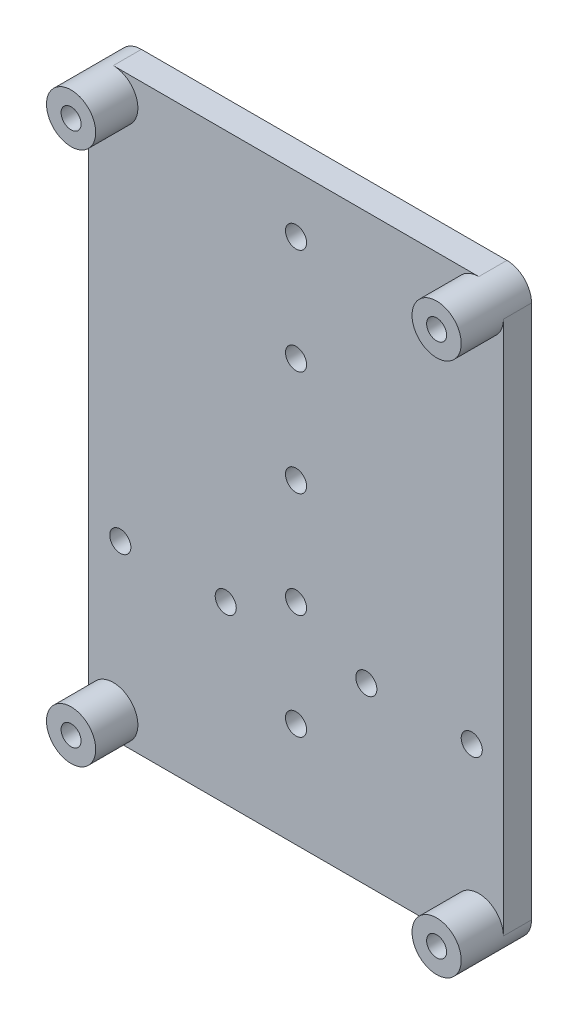
ISO-10303-21;
HEADER;
FILE_DESCRIPTION(('STEP AP214'),'2;1');
FILE_NAME('part.step','',(''),(''),'','','');
FILE_SCHEMA(('AUTOMOTIVE_DESIGN { 1 0 10303 214 1 1 1 1 }'));
ENDSEC;
DATA;
#1=APPLICATION_CONTEXT('core data for automotive mechanical design processes');
#2=APPLICATION_PROTOCOL_DEFINITION('international standard','automotive_design',2000,#1);
#3=PRODUCT_CONTEXT('',#1,'mechanical');
#4=PRODUCT('Part','Part','',(#3));
#5=PRODUCT_RELATED_PRODUCT_CATEGORY('part','',(#4));
#6=PRODUCT_DEFINITION_FORMATION('','',#4);
#7=PRODUCT_DEFINITION_CONTEXT('part definition',#1,'design');
#8=PRODUCT_DEFINITION('design','',#6,#7);
#9=PRODUCT_DEFINITION_SHAPE('','',#8);
#10=(LENGTH_UNIT() NAMED_UNIT(*) SI_UNIT(.MILLI.,.METRE.));
#11=(NAMED_UNIT(*) PLANE_ANGLE_UNIT() SI_UNIT($,.RADIAN.));
#12=(NAMED_UNIT(*) SI_UNIT($,.STERADIAN.) SOLID_ANGLE_UNIT());
#13=UNCERTAINTY_MEASURE_WITH_UNIT(LENGTH_MEASURE(1.E-05),#10,'distance_accuracy_value','');
#14=(GEOMETRIC_REPRESENTATION_CONTEXT(3) GLOBAL_UNCERTAINTY_ASSIGNED_CONTEXT((#13)) GLOBAL_UNIT_ASSIGNED_CONTEXT((#10,
#11,#12)) REPRESENTATION_CONTEXT('',''));
#15=CARTESIAN_POINT('',(0.,0.,0.));
#16=DIRECTION('',(0.,0.,1.));
#17=DIRECTION('',(1.,0.,0.));
#18=AXIS2_PLACEMENT_3D('',#15,#16,#17);
#19=CARTESIAN_POINT('',(108.526557276723,189.230165260636,193.266714262562));
#20=DIRECTION('',(0.,0.,1.));
#21=DIRECTION('',(1.,0.,0.));
#22=AXIS2_PLACEMENT_3D('',#19,#20,#21);
#23=PLANE('',#22);
#24=CARTESIAN_POINT('',(134.526557276723,184.637085274738,193.266714262562));
#25=DIRECTION('',(0.,0.,1.));
#26=DIRECTION('',(1.,0.,0.));
#27=AXIS2_PLACEMENT_3D('',#24,#25,#26);
#28=CIRCLE('',#27,1.5);
#29=CARTESIAN_POINT('',(136.026557276723,184.637085274738,193.266714262562));
#30=VERTEX_POINT('',#29);
#31=EDGE_CURVE('E172',#30,#30,#28,.T.);
#32=ORIENTED_EDGE('',*,*,#31,.F.);
#33=EDGE_LOOP('',(#32));
#34=FACE_BOUND('',#33,.T.);
#35=CARTESIAN_POINT('',(134.526557276723,154.637085274738,193.266714262562));
#36=DIRECTION('',(0.,0.,1.));
#37=DIRECTION('',(1.,0.,0.));
#38=AXIS2_PLACEMENT_3D('',#35,#36,#37);
#39=CIRCLE('',#38,1.5);
#40=CARTESIAN_POINT('',(136.026557276723,154.637085274738,193.266714262562));
#41=VERTEX_POINT('',#40);
#42=EDGE_CURVE('E184',#41,#41,#39,.T.);
#43=ORIENTED_EDGE('',*,*,#42,.F.);
#44=EDGE_LOOP('',(#43));
#45=FACE_BOUND('',#44,.T.);
#46=CARTESIAN_POINT('',(144.526557276723,134.637085274738,193.266714262562));
#47=DIRECTION('',(0.,0.,1.));
#48=DIRECTION('',(1.,0.,0.));
#49=AXIS2_PLACEMENT_3D('',#46,#47,#48);
#50=CIRCLE('',#49,1.5);
#51=CARTESIAN_POINT('',(146.026557276723,134.637085274738,193.266714262562));
#52=VERTEX_POINT('',#51);
#53=EDGE_CURVE('E196',#52,#52,#50,.T.);
#54=ORIENTED_EDGE('',*,*,#53,.F.);
#55=EDGE_LOOP('',(#54));
#56=FACE_BOUND('',#55,.T.);
#57=CARTESIAN_POINT('',(124.526557276723,134.637085274738,193.266714262562));
#58=DIRECTION('',(0.,0.,1.));
#59=DIRECTION('',(1.,0.,0.));
#60=AXIS2_PLACEMENT_3D('',#57,#58,#59);
#61=CIRCLE('',#60,1.49999999999998);
#62=CARTESIAN_POINT('',(126.026557276723,134.637085274738,193.266714262562));
#63=VERTEX_POINT('',#62);
#64=EDGE_CURVE('E208',#63,#63,#61,.T.);
#65=ORIENTED_EDGE('',*,*,#64,.F.);
#66=EDGE_LOOP('',(#65));
#67=FACE_BOUND('',#66,.T.);
#68=CARTESIAN_POINT('',(134.526557276723,124.637085274738,193.266714262562));
#69=DIRECTION('',(0.,0.,1.));
#70=DIRECTION('',(1.,0.,0.));
#71=AXIS2_PLACEMENT_3D('',#68,#69,#70);
#72=CIRCLE('',#71,1.5);
#73=CARTESIAN_POINT('',(136.026557276723,124.637085274738,193.266714262562));
#74=VERTEX_POINT('',#73);
#75=EDGE_CURVE('E220',#74,#74,#72,.T.);
#76=ORIENTED_EDGE('',*,*,#75,.F.);
#77=EDGE_LOOP('',(#76));
#78=FACE_BOUND('',#77,.T.);
#79=CARTESIAN_POINT('',(109.526557276723,134.637085274738,193.266714262562));
#80=DIRECTION('',(0.,0.,1.));
#81=DIRECTION('',(1.,0.,0.));
#82=AXIS2_PLACEMENT_3D('',#79,#80,#81);
#83=CIRCLE('',#82,1.5);
#84=CARTESIAN_POINT('',(111.026557276723,134.637085274738,193.266714262562));
#85=VERTEX_POINT('',#84);
#86=EDGE_CURVE('E214',#85,#85,#83,.T.);
#87=ORIENTED_EDGE('',*,*,#86,.F.);
#88=EDGE_LOOP('',(#87));
#89=FACE_BOUND('',#88,.T.);
#90=CARTESIAN_POINT('',(159.526557276723,134.637085274738,193.266714262562));
#91=DIRECTION('',(0.,0.,1.));
#92=DIRECTION('',(1.,0.,0.));
#93=AXIS2_PLACEMENT_3D('',#90,#91,#92);
#94=CIRCLE('',#93,1.49999999999997);
#95=CARTESIAN_POINT('',(161.026557276723,134.637085274738,193.266714262562));
#96=VERTEX_POINT('',#95);
#97=EDGE_CURVE('E202',#96,#96,#94,.T.);
#98=ORIENTED_EDGE('',*,*,#97,.F.);
#99=EDGE_LOOP('',(#98));
#100=FACE_BOUND('',#99,.T.);
#101=CARTESIAN_POINT('',(134.526557276723,139.637085274738,193.266714262562));
#102=DIRECTION('',(0.,0.,1.));
#103=DIRECTION('',(1.,0.,0.));
#104=AXIS2_PLACEMENT_3D('',#101,#102,#103);
#105=CIRCLE('',#104,1.5);
#106=CARTESIAN_POINT('',(136.026557276723,139.637085274738,193.266714262562));
#107=VERTEX_POINT('',#106);
#108=EDGE_CURVE('E190',#107,#107,#105,.T.);
#109=ORIENTED_EDGE('',*,*,#108,.F.);
#110=EDGE_LOOP('',(#109));
#111=FACE_BOUND('',#110,.T.);
#112=CARTESIAN_POINT('',(134.526557276723,169.637085274738,193.266714262562));
#113=DIRECTION('',(0.,0.,1.));
#114=DIRECTION('',(1.,0.,0.));
#115=AXIS2_PLACEMENT_3D('',#112,#113,#114);
#116=CIRCLE('',#115,1.5);
#117=CARTESIAN_POINT('',(136.026557276723,169.637085274738,193.266714262562));
#118=VERTEX_POINT('',#117);
#119=EDGE_CURVE('E178',#118,#118,#116,.T.);
#120=ORIENTED_EDGE('',*,*,#119,.F.);
#121=EDGE_LOOP('',(#120));
#122=FACE_BOUND('',#121,.T.);
#123=DIRECTION('',(1.,0.,0.));
#124=VECTOR('',#123,1.);
#125=CARTESIAN_POINT('',(108.526557276723,109.730165260636,193.266714262562));
#126=LINE('',#125,#124);
#127=CARTESIAN_POINT('',(108.526557276723,109.730165260636,193.266714262562));
#128=VERTEX_POINT('',#127);
#129=CARTESIAN_POINT('',(160.526557276723,109.730165260636,193.266714262562));
#130=VERTEX_POINT('',#129);
#131=EDGE_CURVE('E114',#128,#130,#126,.T.);
#132=ORIENTED_EDGE('',*,*,#131,.T.);
#133=CARTESIAN_POINT('',(160.526557276723,113.230165260636,193.266714262562));
#134=DIRECTION('',(0.,0.,1.));
#135=DIRECTION('',(1.,0.,0.));
#136=AXIS2_PLACEMENT_3D('',#133,#134,#135);
#137=CIRCLE('',#136,3.50000000000002);
#138=CARTESIAN_POINT('',(164.026557276723,113.230165260636,193.266714262562));
#139=VERTEX_POINT('',#138);
#140=EDGE_CURVE('E121',#139,#130,#137,.T.);
#141=ORIENTED_EDGE('',*,*,#140,.F.);
#142=DIRECTION('',(0.,1.,0.));
#143=VECTOR('',#142,1.);
#144=CARTESIAN_POINT('',(164.026557276723,113.230165260636,193.266714262562));
#145=LINE('',#144,#143);
#146=CARTESIAN_POINT('',(164.026557276723,189.230165260636,193.266714262562));
#147=VERTEX_POINT('',#146);
#148=EDGE_CURVE('E51',#139,#147,#145,.T.);
#149=ORIENTED_EDGE('',*,*,#148,.T.);
#150=CARTESIAN_POINT('',(160.526557276723,189.230165260636,193.266714262562));
#151=DIRECTION('',(0.,0.,1.));
#152=DIRECTION('',(1.,0.,0.));
#153=AXIS2_PLACEMENT_3D('',#150,#151,#152);
#154=CIRCLE('',#153,3.49999999999999);
#155=CARTESIAN_POINT('',(160.526557276723,192.730165260636,193.266714262562));
#156=VERTEX_POINT('',#155);
#157=EDGE_CURVE('E148',#156,#147,#154,.T.);
#158=ORIENTED_EDGE('',*,*,#157,.F.);
#159=DIRECTION('',(-1.,0.,0.));
#160=VECTOR('',#159,1.);
#161=CARTESIAN_POINT('',(160.526557276723,192.730165260636,193.266714262562));
#162=LINE('',#161,#160);
#163=CARTESIAN_POINT('',(108.526557276723,192.730165260636,193.266714262562));
#164=VERTEX_POINT('',#163);
#165=EDGE_CURVE('E113',#156,#164,#162,.T.);
#166=ORIENTED_EDGE('',*,*,#165,.T.);
#167=CARTESIAN_POINT('',(108.526557276723,189.230165260636,193.266714262562));
#168=DIRECTION('',(0.,0.,1.));
#169=DIRECTION('',(1.,0.,0.));
#170=AXIS2_PLACEMENT_3D('',#167,#168,#169);
#171=CIRCLE('',#170,3.50000000000002);
#172=CARTESIAN_POINT('',(105.026557276723,189.230165260636,193.266714262562));
#173=VERTEX_POINT('',#172);
#174=EDGE_CURVE('E11',#173,#164,#171,.T.);
#175=ORIENTED_EDGE('',*,*,#174,.F.);
#176=DIRECTION('',(0.,-1.,0.));
#177=VECTOR('',#176,1.);
#178=CARTESIAN_POINT('',(105.026557276723,189.230165260636,193.266714262562));
#179=LINE('',#178,#177);
#180=CARTESIAN_POINT('',(105.026557276723,113.230165260636,193.266714262562));
#181=VERTEX_POINT('',#180);
#182=EDGE_CURVE('E226',#173,#181,#179,.T.);
#183=ORIENTED_EDGE('',*,*,#182,.T.);
#184=CARTESIAN_POINT('',(108.526557276723,113.230165260636,193.266714262562));
#185=DIRECTION('',(0.,0.,1.));
#186=DIRECTION('',(1.,0.,0.));
#187=AXIS2_PLACEMENT_3D('',#184,#185,#186);
#188=CIRCLE('',#187,3.50000000000002);
#189=EDGE_CURVE('E139',#128,#181,#188,.T.);
#190=ORIENTED_EDGE('',*,*,#189,.F.);
#191=EDGE_LOOP('',(#132,#141,#149,#158,#166,#175,#183,#190));
#192=FACE_BOUND('',#191,.T.);
#193=ADVANCED_FACE('F33',(#34,#45,#56,#67,#78,#89,#100,#111,#122,#192),#23,.T.);
#194=CARTESIAN_POINT('',(108.526557276723,189.230165260636,189.266714262562));
#195=DIRECTION('',(0.,0.,1.));
#196=DIRECTION('',(1.,0.,0.));
#197=AXIS2_PLACEMENT_3D('',#194,#195,#196);
#198=PLANE('',#197);
#199=CARTESIAN_POINT('',(108.526557276723,189.230165260636,189.266714262562));
#200=DIRECTION('',(0.,0.,1.));
#201=DIRECTION('',(1.,0.,0.));
#202=AXIS2_PLACEMENT_3D('',#199,#200,#201);
#203=CIRCLE('',#202,3.5);
#204=CARTESIAN_POINT('',(108.526557276723,192.730165260636,189.266714262562));
#205=VERTEX_POINT('',#204);
#206=CARTESIAN_POINT('',(105.026557276723,189.230165260636,189.266714262562));
#207=VERTEX_POINT('',#206);
#208=EDGE_CURVE('E223',#205,#207,#203,.T.);
#209=ORIENTED_EDGE('',*,*,#208,.F.);
#210=DIRECTION('',(-1.,0.,0.));
#211=VECTOR('',#210,1.);
#212=CARTESIAN_POINT('',(160.526557276723,192.730165260636,189.266714262562));
#213=LINE('',#212,#211);
#214=CARTESIAN_POINT('',(160.526557276723,192.730165260636,189.266714262562));
#215=VERTEX_POINT('',#214);
#216=EDGE_CURVE('E89',#215,#205,#213,.T.);
#217=ORIENTED_EDGE('',*,*,#216,.F.);
#218=CARTESIAN_POINT('',(160.526557276723,189.230165260636,189.266714262562));
#219=DIRECTION('',(0.,0.,1.));
#220=DIRECTION('',(1.,0.,0.));
#221=AXIS2_PLACEMENT_3D('',#218,#219,#220);
#222=CIRCLE('',#221,3.5);
#223=CARTESIAN_POINT('',(164.026557276723,189.230165260636,189.266714262562));
#224=VERTEX_POINT('',#223);
#225=EDGE_CURVE('E82',#224,#215,#222,.T.);
#226=ORIENTED_EDGE('',*,*,#225,.F.);
#227=DIRECTION('',(0.,1.,0.));
#228=VECTOR('',#227,1.);
#229=CARTESIAN_POINT('',(164.026557276723,113.230165260636,189.266714262562));
#230=LINE('',#229,#228);
#231=CARTESIAN_POINT('',(164.026557276723,113.230165260636,189.266714262562));
#232=VERTEX_POINT('',#231);
#233=EDGE_CURVE('E240',#232,#224,#230,.T.);
#234=ORIENTED_EDGE('',*,*,#233,.F.);
#235=CARTESIAN_POINT('',(160.526557276723,113.230165260636,189.266714262562));
#236=DIRECTION('',(0.,0.,1.));
#237=DIRECTION('',(1.,0.,0.));
#238=AXIS2_PLACEMENT_3D('',#235,#236,#237);
#239=CIRCLE('',#238,3.50000000000002);
#240=CARTESIAN_POINT('',(160.526557276723,109.730165260636,189.266714262562));
#241=VERTEX_POINT('',#240);
#242=EDGE_CURVE('E123',#241,#232,#239,.T.);
#243=ORIENTED_EDGE('',*,*,#242,.F.);
#244=DIRECTION('',(1.,0.,0.));
#245=VECTOR('',#244,1.);
#246=CARTESIAN_POINT('',(108.526557276723,109.730165260636,189.266714262562));
#247=LINE('',#246,#245);
#248=CARTESIAN_POINT('',(108.526557276723,109.730165260636,189.266714262562));
#249=VERTEX_POINT('',#248);
#250=EDGE_CURVE('E237',#249,#241,#247,.T.);
#251=ORIENTED_EDGE('',*,*,#250,.F.);
#252=CARTESIAN_POINT('',(108.526557276723,113.230165260636,189.266714262562));
#253=DIRECTION('',(0.,0.,1.));
#254=DIRECTION('',(1.,0.,0.));
#255=AXIS2_PLACEMENT_3D('',#252,#253,#254);
#256=CIRCLE('',#255,3.50000000000002);
#257=CARTESIAN_POINT('',(105.026557276723,113.230165260636,189.266714262562));
#258=VERTEX_POINT('',#257);
#259=EDGE_CURVE('E235',#258,#249,#256,.T.);
#260=ORIENTED_EDGE('',*,*,#259,.F.);
#261=DIRECTION('',(0.,-1.,0.));
#262=VECTOR('',#261,1.);
#263=CARTESIAN_POINT('',(105.026557276723,189.230165260636,189.266714262562));
#264=LINE('',#263,#262);
#265=EDGE_CURVE('E233',#207,#258,#264,.T.);
#266=ORIENTED_EDGE('',*,*,#265,.F.);
#267=EDGE_LOOP('',(#209,#217,#226,#234,#243,#251,#260,#266));
#268=FACE_BOUND('',#267,.T.);
#269=CARTESIAN_POINT('',(134.526557276723,124.637085274738,189.266714262562));
#270=DIRECTION('',(0.,0.,1.));
#271=DIRECTION('',(1.,0.,0.));
#272=AXIS2_PLACEMENT_3D('',#269,#270,#271);
#273=CIRCLE('',#272,1.5);
#274=CARTESIAN_POINT('',(136.026557276723,124.637085274738,189.266714262562));
#275=VERTEX_POINT('',#274);
#276=EDGE_CURVE('E217',#275,#275,#273,.T.);
#277=ORIENTED_EDGE('',*,*,#276,.T.);
#278=EDGE_LOOP('',(#277));
#279=FACE_BOUND('',#278,.T.);
#280=CARTESIAN_POINT('',(109.526557276723,134.637085274738,189.266714262562));
#281=DIRECTION('',(0.,0.,1.));
#282=DIRECTION('',(1.,0.,0.));
#283=AXIS2_PLACEMENT_3D('',#280,#281,#282);
#284=CIRCLE('',#283,1.5);
#285=CARTESIAN_POINT('',(111.026557276723,134.637085274738,189.266714262562));
#286=VERTEX_POINT('',#285);
#287=EDGE_CURVE('E211',#286,#286,#284,.T.);
#288=ORIENTED_EDGE('',*,*,#287,.T.);
#289=EDGE_LOOP('',(#288));
#290=FACE_BOUND('',#289,.T.);
#291=CARTESIAN_POINT('',(124.526557276723,134.637085274738,189.266714262562));
#292=DIRECTION('',(0.,0.,1.));
#293=DIRECTION('',(1.,0.,0.));
#294=AXIS2_PLACEMENT_3D('',#291,#292,#293);
#295=CIRCLE('',#294,1.49999999999998);
#296=CARTESIAN_POINT('',(126.026557276723,134.637085274738,189.266714262562));
#297=VERTEX_POINT('',#296);
#298=EDGE_CURVE('E205',#297,#297,#295,.T.);
#299=ORIENTED_EDGE('',*,*,#298,.T.);
#300=EDGE_LOOP('',(#299));
#301=FACE_BOUND('',#300,.T.);
#302=CARTESIAN_POINT('',(159.526557276723,134.637085274738,189.266714262562));
#303=DIRECTION('',(0.,0.,1.));
#304=DIRECTION('',(1.,0.,0.));
#305=AXIS2_PLACEMENT_3D('',#302,#303,#304);
#306=CIRCLE('',#305,1.49999999999997);
#307=CARTESIAN_POINT('',(161.026557276723,134.637085274738,189.266714262562));
#308=VERTEX_POINT('',#307);
#309=EDGE_CURVE('E199',#308,#308,#306,.T.);
#310=ORIENTED_EDGE('',*,*,#309,.T.);
#311=EDGE_LOOP('',(#310));
#312=FACE_BOUND('',#311,.T.);
#313=CARTESIAN_POINT('',(144.526557276723,134.637085274738,189.266714262562));
#314=DIRECTION('',(0.,0.,1.));
#315=DIRECTION('',(1.,0.,0.));
#316=AXIS2_PLACEMENT_3D('',#313,#314,#315);
#317=CIRCLE('',#316,1.5);
#318=CARTESIAN_POINT('',(146.026557276723,134.637085274738,189.266714262562));
#319=VERTEX_POINT('',#318);
#320=EDGE_CURVE('E193',#319,#319,#317,.T.);
#321=ORIENTED_EDGE('',*,*,#320,.T.);
#322=EDGE_LOOP('',(#321));
#323=FACE_BOUND('',#322,.T.);
#324=CARTESIAN_POINT('',(134.526557276723,139.637085274738,189.266714262562));
#325=DIRECTION('',(0.,0.,1.));
#326=DIRECTION('',(1.,0.,0.));
#327=AXIS2_PLACEMENT_3D('',#324,#325,#326);
#328=CIRCLE('',#327,1.5);
#329=CARTESIAN_POINT('',(136.026557276723,139.637085274738,189.266714262562));
#330=VERTEX_POINT('',#329);
#331=EDGE_CURVE('E187',#330,#330,#328,.T.);
#332=ORIENTED_EDGE('',*,*,#331,.T.);
#333=EDGE_LOOP('',(#332));
#334=FACE_BOUND('',#333,.T.);
#335=CARTESIAN_POINT('',(134.526557276723,154.637085274738,189.266714262562));
#336=DIRECTION('',(0.,0.,1.));
#337=DIRECTION('',(1.,0.,0.));
#338=AXIS2_PLACEMENT_3D('',#335,#336,#337);
#339=CIRCLE('',#338,1.5);
#340=CARTESIAN_POINT('',(136.026557276723,154.637085274738,189.266714262562));
#341=VERTEX_POINT('',#340);
#342=EDGE_CURVE('E181',#341,#341,#339,.T.);
#343=ORIENTED_EDGE('',*,*,#342,.T.);
#344=EDGE_LOOP('',(#343));
#345=FACE_BOUND('',#344,.T.);
#346=CARTESIAN_POINT('',(134.526557276723,169.637085274738,189.266714262562));
#347=DIRECTION('',(0.,0.,1.));
#348=DIRECTION('',(1.,0.,0.));
#349=AXIS2_PLACEMENT_3D('',#346,#347,#348);
#350=CIRCLE('',#349,1.5);
#351=CARTESIAN_POINT('',(136.026557276723,169.637085274738,189.266714262562));
#352=VERTEX_POINT('',#351);
#353=EDGE_CURVE('E175',#352,#352,#350,.T.);
#354=ORIENTED_EDGE('',*,*,#353,.T.);
#355=EDGE_LOOP('',(#354));
#356=FACE_BOUND('',#355,.T.);
#357=CARTESIAN_POINT('',(134.526557276723,184.637085274738,189.266714262562));
#358=DIRECTION('',(0.,0.,1.));
#359=DIRECTION('',(1.,0.,0.));
#360=AXIS2_PLACEMENT_3D('',#357,#358,#359);
#361=CIRCLE('',#360,1.5);
#362=CARTESIAN_POINT('',(136.026557276723,184.637085274738,189.266714262562));
#363=VERTEX_POINT('',#362);
#364=EDGE_CURVE('E171',#363,#363,#361,.T.);
#365=ORIENTED_EDGE('',*,*,#364,.T.);
#366=EDGE_LOOP('',(#365));
#367=FACE_BOUND('',#366,.T.);
#368=CARTESIAN_POINT('',(108.526557276723,189.230165260636,189.266714262562));
#369=DIRECTION('',(0.,0.,1.));
#370=DIRECTION('',(1.,0.,0.));
#371=AXIS2_PLACEMENT_3D('',#368,#369,#370);
#372=CIRCLE('',#371,1.42240000000001);
#373=CARTESIAN_POINT('',(109.948957276723,189.230165260636,189.266714262562));
#374=VERTEX_POINT('',#373);
#375=EDGE_CURVE('E168',#374,#374,#372,.T.);
#376=ORIENTED_EDGE('',*,*,#375,.T.);
#377=EDGE_LOOP('',(#376));
#378=FACE_BOUND('',#377,.T.);
#379=CARTESIAN_POINT('',(160.526557276723,189.230165260636,189.266714262562));
#380=DIRECTION('',(0.,0.,1.));
#381=DIRECTION('',(1.,0.,0.));
#382=AXIS2_PLACEMENT_3D('',#379,#380,#381);
#383=CIRCLE('',#382,1.42240000000002);
#384=CARTESIAN_POINT('',(161.948957276723,189.230165260636,189.266714262562));
#385=VERTEX_POINT('',#384);
#386=EDGE_CURVE('E165',#385,#385,#383,.T.);
#387=ORIENTED_EDGE('',*,*,#386,.T.);
#388=EDGE_LOOP('',(#387));
#389=FACE_BOUND('',#388,.T.);
#390=CARTESIAN_POINT('',(160.526557276723,113.230165260636,189.266714262562));
#391=DIRECTION('',(0.,0.,1.));
#392=DIRECTION('',(1.,0.,0.));
#393=AXIS2_PLACEMENT_3D('',#390,#391,#392);
#394=CIRCLE('',#393,1.42240000000002);
#395=CARTESIAN_POINT('',(161.948957276723,113.230165260636,189.266714262562));
#396=VERTEX_POINT('',#395);
#397=EDGE_CURVE('E162',#396,#396,#394,.T.);
#398=ORIENTED_EDGE('',*,*,#397,.T.);
#399=EDGE_LOOP('',(#398));
#400=FACE_BOUND('',#399,.T.);
#401=CARTESIAN_POINT('',(108.526557276723,113.230165260636,189.266714262562));
#402=DIRECTION('',(0.,0.,1.));
#403=DIRECTION('',(1.,0.,0.));
#404=AXIS2_PLACEMENT_3D('',#401,#402,#403);
#405=CIRCLE('',#404,1.4224);
#406=CARTESIAN_POINT('',(109.948957276723,113.230165260636,189.266714262562));
#407=VERTEX_POINT('',#406);
#408=EDGE_CURVE('E158',#407,#407,#405,.T.);
#409=ORIENTED_EDGE('',*,*,#408,.T.);
#410=EDGE_LOOP('',(#409));
#411=FACE_BOUND('',#410,.T.);
#412=ADVANCED_FACE('F264',(#268,#279,#290,#301,#312,#323,#334,#345,#356,#367,#378,#389,#400,
#411),#198,.F.);
#413=CARTESIAN_POINT('',(108.526557276723,189.230165260636,193.266714262562));
#414=DIRECTION('',(0.,0.,-1.));
#415=DIRECTION('',(-1.,0.,0.));
#416=AXIS2_PLACEMENT_3D('',#413,#414,#415);
#417=CYLINDRICAL_SURFACE('',#416,3.5);
#418=ORIENTED_EDGE('',*,*,#208,.T.);
#419=DIRECTION('',(0.,0.,-1.));
#420=VECTOR('',#419,1.);
#421=CARTESIAN_POINT('',(105.026557276723,189.230165260636,193.266714262562));
#422=LINE('',#421,#420);
#423=EDGE_CURVE('E37',#173,#207,#422,.T.);
#424=ORIENTED_EDGE('',*,*,#423,.F.);
#425=ORIENTED_EDGE('',*,*,#174,.T.);
#426=DIRECTION('',(0.,0.,-1.));
#427=VECTOR('',#426,1.);
#428=CARTESIAN_POINT('',(108.526557276723,192.730165260636,193.266714262562));
#429=LINE('',#428,#427);
#430=EDGE_CURVE('E230',#164,#205,#429,.T.);
#431=ORIENTED_EDGE('',*,*,#430,.T.);
#432=EDGE_LOOP('',(#418,#424,#425,#431));
#433=FACE_BOUND('',#432,.T.);
#434=CARTESIAN_POINT('',(108.526557276723,189.230165260636,199.266714262562));
#435=DIRECTION('',(0.,0.,1.));
#436=DIRECTION('',(1.,0.,0.));
#437=AXIS2_PLACEMENT_3D('',#434,#435,#436);
#438=CIRCLE('',#437,3.50000000000002);
#439=CARTESIAN_POINT('',(112.026557276723,189.230165260636,199.266714262562));
#440=VERTEX_POINT('',#439);
#441=EDGE_CURVE('E156',#440,#440,#438,.T.);
#442=ORIENTED_EDGE('',*,*,#441,.F.);
#443=EDGE_LOOP('',(#442));
#444=FACE_BOUND('',#443,.T.);
#445=ADVANCED_FACE('F35',(#433,#444),#417,.T.);
#446=CARTESIAN_POINT('',(105.026557276723,189.230165260636,193.266714262562));
#447=DIRECTION('',(1.,0.,0.));
#448=DIRECTION('',(0.,1.,0.));
#449=AXIS2_PLACEMENT_3D('',#446,#447,#448);
#450=PLANE('',#449);
#451=ORIENTED_EDGE('',*,*,#265,.T.);
#452=DIRECTION('',(0.,0.,-1.));
#453=VECTOR('',#452,1.);
#454=CARTESIAN_POINT('',(105.026557276723,113.230165260636,193.266714262562));
#455=LINE('',#454,#453);
#456=EDGE_CURVE('E251',#181,#258,#455,.T.);
#457=ORIENTED_EDGE('',*,*,#456,.F.);
#458=ORIENTED_EDGE('',*,*,#182,.F.);
#459=ORIENTED_EDGE('',*,*,#423,.T.);
#460=EDGE_LOOP('',(#451,#457,#458,#459));
#461=FACE_BOUND('',#460,.T.);
#462=ADVANCED_FACE('F259',(#461),#450,.F.);
#463=CARTESIAN_POINT('',(108.526557276723,113.230165260636,193.266714262562));
#464=DIRECTION('',(0.,0.,-1.));
#465=DIRECTION('',(-1.,0.,0.));
#466=AXIS2_PLACEMENT_3D('',#463,#464,#465);
#467=CYLINDRICAL_SURFACE('',#466,3.50000000000002);
#468=ORIENTED_EDGE('',*,*,#259,.T.);
#469=DIRECTION('',(0.,0.,-1.));
#470=VECTOR('',#469,1.);
#471=CARTESIAN_POINT('',(108.526557276723,109.730165260636,193.266714262562));
#472=LINE('',#471,#470);
#473=EDGE_CURVE('E249',#128,#249,#472,.T.);
#474=ORIENTED_EDGE('',*,*,#473,.F.);
#475=ORIENTED_EDGE('',*,*,#189,.T.);
#476=ORIENTED_EDGE('',*,*,#456,.T.);
#477=EDGE_LOOP('',(#468,#474,#475,#476));
#478=FACE_BOUND('',#477,.T.);
#479=CARTESIAN_POINT('',(108.526557276723,113.230165260636,199.266714262562));
#480=DIRECTION('',(0.,0.,1.));
#481=DIRECTION('',(1.,0.,0.));
#482=AXIS2_PLACEMENT_3D('',#479,#480,#481);
#483=CIRCLE('',#482,3.50000000000002);
#484=CARTESIAN_POINT('',(112.026557276723,113.230165260636,199.266714262562));
#485=VERTEX_POINT('',#484);
#486=EDGE_CURVE('E140',#485,#485,#483,.T.);
#487=ORIENTED_EDGE('',*,*,#486,.F.);
#488=EDGE_LOOP('',(#487));
#489=FACE_BOUND('',#488,.T.);
#490=ADVANCED_FACE('F268',(#478,#489),#467,.T.);
#491=CARTESIAN_POINT('',(108.526557276723,109.730165260636,193.266714262562));
#492=DIRECTION('',(0.,1.,0.));
#493=DIRECTION('',(-1.,0.,0.));
#494=AXIS2_PLACEMENT_3D('',#491,#492,#493);
#495=PLANE('',#494);
#496=ORIENTED_EDGE('',*,*,#250,.T.);
#497=DIRECTION('',(0.,0.,-1.));
#498=VECTOR('',#497,1.);
#499=CARTESIAN_POINT('',(160.526557276723,109.730165260636,193.266714262562));
#500=LINE('',#499,#498);
#501=EDGE_CURVE('E124',#130,#241,#500,.T.);
#502=ORIENTED_EDGE('',*,*,#501,.F.);
#503=ORIENTED_EDGE('',*,*,#131,.F.);
#504=ORIENTED_EDGE('',*,*,#473,.T.);
#505=EDGE_LOOP('',(#496,#502,#503,#504));
#506=FACE_BOUND('',#505,.T.);
#507=ADVANCED_FACE('F271',(#506),#495,.F.);
#508=CARTESIAN_POINT('',(160.526557276723,113.230165260636,193.266714262562));
#509=DIRECTION('',(0.,0.,-1.));
#510=DIRECTION('',(-1.,0.,0.));
#511=AXIS2_PLACEMENT_3D('',#508,#509,#510);
#512=CYLINDRICAL_SURFACE('',#511,3.50000000000002);
#513=ORIENTED_EDGE('',*,*,#242,.T.);
#514=DIRECTION('',(0.,0.,-1.));
#515=VECTOR('',#514,1.);
#516=CARTESIAN_POINT('',(164.026557276723,113.230165260636,193.266714262562));
#517=LINE('',#516,#515);
#518=EDGE_CURVE('E109',#139,#232,#517,.T.);
#519=ORIENTED_EDGE('',*,*,#518,.F.);
#520=ORIENTED_EDGE('',*,*,#140,.T.);
#521=ORIENTED_EDGE('',*,*,#501,.T.);
#522=EDGE_LOOP('',(#513,#519,#520,#521));
#523=FACE_BOUND('',#522,.T.);
#524=CARTESIAN_POINT('',(160.526557276723,113.230165260636,199.266714262562));
#525=DIRECTION('',(0.,0.,1.));
#526=DIRECTION('',(1.,0.,0.));
#527=AXIS2_PLACEMENT_3D('',#524,#525,#526);
#528=CIRCLE('',#527,3.50000000000002);
#529=CARTESIAN_POINT('',(164.026557276723,113.230165260636,199.266714262562));
#530=VERTEX_POINT('',#529);
#531=EDGE_CURVE('E128',#530,#530,#528,.T.);
#532=ORIENTED_EDGE('',*,*,#531,.F.);
#533=EDGE_LOOP('',(#532));
#534=FACE_BOUND('',#533,.T.);
#535=ADVANCED_FACE('F118',(#523,#534),#512,.T.);
#536=CARTESIAN_POINT('',(164.026557276723,113.230165260636,193.266714262562));
#537=DIRECTION('',(-1.,0.,0.));
#538=DIRECTION('',(0.,-1.,0.));
#539=AXIS2_PLACEMENT_3D('',#536,#537,#538);
#540=PLANE('',#539);
#541=ORIENTED_EDGE('',*,*,#233,.T.);
#542=DIRECTION('',(0.,0.,-1.));
#543=VECTOR('',#542,1.);
#544=CARTESIAN_POINT('',(164.026557276723,189.230165260636,193.266714262562));
#545=LINE('',#544,#543);
#546=EDGE_CURVE('E111',#147,#224,#545,.T.);
#547=ORIENTED_EDGE('',*,*,#546,.F.);
#548=ORIENTED_EDGE('',*,*,#148,.F.);
#549=ORIENTED_EDGE('',*,*,#518,.T.);
#550=EDGE_LOOP('',(#541,#547,#548,#549));
#551=FACE_BOUND('',#550,.T.);
#552=ADVANCED_FACE('F108',(#551),#540,.F.);
#553=CARTESIAN_POINT('',(160.526557276723,189.230165260636,193.266714262562));
#554=DIRECTION('',(0.,0.,-1.));
#555=DIRECTION('',(-1.,0.,0.));
#556=AXIS2_PLACEMENT_3D('',#553,#554,#555);
#557=CYLINDRICAL_SURFACE('',#556,3.5);
#558=ORIENTED_EDGE('',*,*,#225,.T.);
#559=DIRECTION('',(0.,0.,-1.));
#560=VECTOR('',#559,1.);
#561=CARTESIAN_POINT('',(160.526557276723,192.730165260636,193.266714262562));
#562=LINE('',#561,#560);
#563=EDGE_CURVE('E245',#156,#215,#562,.T.);
#564=ORIENTED_EDGE('',*,*,#563,.F.);
#565=ORIENTED_EDGE('',*,*,#157,.T.);
#566=ORIENTED_EDGE('',*,*,#546,.T.);
#567=EDGE_LOOP('',(#558,#564,#565,#566));
#568=FACE_BOUND('',#567,.T.);
#569=CARTESIAN_POINT('',(160.526557276723,189.230165260636,199.266714262562));
#570=DIRECTION('',(0.,0.,1.));
#571=DIRECTION('',(1.,0.,0.));
#572=AXIS2_PLACEMENT_3D('',#569,#570,#571);
#573=CIRCLE('',#572,3.49999999999999);
#574=CARTESIAN_POINT('',(164.026557276723,189.230165260636,199.266714262562));
#575=VERTEX_POINT('',#574);
#576=EDGE_CURVE('E149',#575,#575,#573,.T.);
#577=ORIENTED_EDGE('',*,*,#576,.F.);
#578=EDGE_LOOP('',(#577));
#579=FACE_BOUND('',#578,.T.);
#580=ADVANCED_FACE('F272',(#568,#579),#557,.T.);
#581=CARTESIAN_POINT('',(160.526557276723,192.730165260636,193.266714262562));
#582=DIRECTION('',(0.,-1.,0.));
#583=DIRECTION('',(0.,0.,-1.));
#584=AXIS2_PLACEMENT_3D('',#581,#582,#583);
#585=PLANE('',#584);
#586=ORIENTED_EDGE('',*,*,#216,.T.);
#587=ORIENTED_EDGE('',*,*,#430,.F.);
#588=ORIENTED_EDGE('',*,*,#165,.F.);
#589=ORIENTED_EDGE('',*,*,#563,.T.);
#590=EDGE_LOOP('',(#586,#587,#588,#589));
#591=FACE_BOUND('',#590,.T.);
#592=ADVANCED_FACE('F274',(#591),#585,.F.);
#593=CARTESIAN_POINT('',(134.526557276723,124.637085274738,193.266714262562));
#594=DIRECTION('',(0.,0.,-1.));
#595=DIRECTION('',(-1.,0.,0.));
#596=AXIS2_PLACEMENT_3D('',#593,#594,#595);
#597=CYLINDRICAL_SURFACE('',#596,1.5);
#598=ORIENTED_EDGE('',*,*,#75,.T.);
#599=EDGE_LOOP('',(#598));
#600=FACE_BOUND('',#599,.T.);
#601=ORIENTED_EDGE('',*,*,#276,.F.);
#602=EDGE_LOOP('',(#601));
#603=FACE_BOUND('',#602,.T.);
#604=ADVANCED_FACE('F276',(#600,#603),#597,.F.);
#605=CARTESIAN_POINT('',(109.526557276723,134.637085274738,193.266714262562));
#606=DIRECTION('',(0.,0.,-1.));
#607=DIRECTION('',(-1.,0.,0.));
#608=AXIS2_PLACEMENT_3D('',#605,#606,#607);
#609=CYLINDRICAL_SURFACE('',#608,1.5);
#610=ORIENTED_EDGE('',*,*,#86,.T.);
#611=EDGE_LOOP('',(#610));
#612=FACE_BOUND('',#611,.T.);
#613=ORIENTED_EDGE('',*,*,#287,.F.);
#614=EDGE_LOOP('',(#613));
#615=FACE_BOUND('',#614,.T.);
#616=ADVANCED_FACE('F282',(#612,#615),#609,.F.);
#617=CARTESIAN_POINT('',(124.526557276723,134.637085274738,193.266714262562));
#618=DIRECTION('',(0.,0.,-1.));
#619=DIRECTION('',(-1.,0.,0.));
#620=AXIS2_PLACEMENT_3D('',#617,#618,#619);
#621=CYLINDRICAL_SURFACE('',#620,1.49999999999998);
#622=ORIENTED_EDGE('',*,*,#64,.T.);
#623=EDGE_LOOP('',(#622));
#624=FACE_BOUND('',#623,.T.);
#625=ORIENTED_EDGE('',*,*,#298,.F.);
#626=EDGE_LOOP('',(#625));
#627=FACE_BOUND('',#626,.T.);
#628=ADVANCED_FACE('F298',(#624,#627),#621,.F.);
#629=CARTESIAN_POINT('',(159.526557276723,134.637085274738,193.266714262562));
#630=DIRECTION('',(0.,0.,-1.));
#631=DIRECTION('',(-1.,0.,0.));
#632=AXIS2_PLACEMENT_3D('',#629,#630,#631);
#633=CYLINDRICAL_SURFACE('',#632,1.49999999999997);
#634=ORIENTED_EDGE('',*,*,#97,.T.);
#635=EDGE_LOOP('',(#634));
#636=FACE_BOUND('',#635,.T.);
#637=ORIENTED_EDGE('',*,*,#309,.F.);
#638=EDGE_LOOP('',(#637));
#639=FACE_BOUND('',#638,.T.);
#640=ADVANCED_FACE('F302',(#636,#639),#633,.F.);
#641=CARTESIAN_POINT('',(144.526557276723,134.637085274738,193.266714262562));
#642=DIRECTION('',(0.,0.,-1.));
#643=DIRECTION('',(-1.,0.,0.));
#644=AXIS2_PLACEMENT_3D('',#641,#642,#643);
#645=CYLINDRICAL_SURFACE('',#644,1.5);
#646=ORIENTED_EDGE('',*,*,#53,.T.);
#647=EDGE_LOOP('',(#646));
#648=FACE_BOUND('',#647,.T.);
#649=ORIENTED_EDGE('',*,*,#320,.F.);
#650=EDGE_LOOP('',(#649));
#651=FACE_BOUND('',#650,.T.);
#652=ADVANCED_FACE('F306',(#648,#651),#645,.F.);
#653=CARTESIAN_POINT('',(134.526557276723,139.637085274738,193.266714262562));
#654=DIRECTION('',(0.,0.,-1.));
#655=DIRECTION('',(-1.,0.,0.));
#656=AXIS2_PLACEMENT_3D('',#653,#654,#655);
#657=CYLINDRICAL_SURFACE('',#656,1.5);
#658=ORIENTED_EDGE('',*,*,#108,.T.);
#659=EDGE_LOOP('',(#658));
#660=FACE_BOUND('',#659,.T.);
#661=ORIENTED_EDGE('',*,*,#331,.F.);
#662=EDGE_LOOP('',(#661));
#663=FACE_BOUND('',#662,.T.);
#664=ADVANCED_FACE('F310',(#660,#663),#657,.F.);
#665=CARTESIAN_POINT('',(134.526557276723,154.637085274738,193.266714262562));
#666=DIRECTION('',(0.,0.,-1.));
#667=DIRECTION('',(-1.,0.,0.));
#668=AXIS2_PLACEMENT_3D('',#665,#666,#667);
#669=CYLINDRICAL_SURFACE('',#668,1.5);
#670=ORIENTED_EDGE('',*,*,#42,.T.);
#671=EDGE_LOOP('',(#670));
#672=FACE_BOUND('',#671,.T.);
#673=ORIENTED_EDGE('',*,*,#342,.F.);
#674=EDGE_LOOP('',(#673));
#675=FACE_BOUND('',#674,.T.);
#676=ADVANCED_FACE('F314',(#672,#675),#669,.F.);
#677=CARTESIAN_POINT('',(134.526557276723,169.637085274738,193.266714262562));
#678=DIRECTION('',(0.,0.,-1.));
#679=DIRECTION('',(-1.,0.,0.));
#680=AXIS2_PLACEMENT_3D('',#677,#678,#679);
#681=CYLINDRICAL_SURFACE('',#680,1.5);
#682=ORIENTED_EDGE('',*,*,#119,.T.);
#683=EDGE_LOOP('',(#682));
#684=FACE_BOUND('',#683,.T.);
#685=ORIENTED_EDGE('',*,*,#353,.F.);
#686=EDGE_LOOP('',(#685));
#687=FACE_BOUND('',#686,.T.);
#688=ADVANCED_FACE('F318',(#684,#687),#681,.F.);
#689=CARTESIAN_POINT('',(134.526557276723,184.637085274738,193.266714262562));
#690=DIRECTION('',(0.,0.,-1.));
#691=DIRECTION('',(-1.,0.,0.));
#692=AXIS2_PLACEMENT_3D('',#689,#690,#691);
#693=CYLINDRICAL_SURFACE('',#692,1.5);
#694=ORIENTED_EDGE('',*,*,#31,.T.);
#695=EDGE_LOOP('',(#694));
#696=FACE_BOUND('',#695,.T.);
#697=ORIENTED_EDGE('',*,*,#364,.F.);
#698=EDGE_LOOP('',(#697));
#699=FACE_BOUND('',#698,.T.);
#700=ADVANCED_FACE('F322',(#696,#699),#693,.F.);
#701=CARTESIAN_POINT('',(108.526557276723,189.230165260636,193.266714262562));
#702=DIRECTION('',(0.,0.,-1.));
#703=DIRECTION('',(-1.,0.,0.));
#704=AXIS2_PLACEMENT_3D('',#701,#702,#703);
#705=CYLINDRICAL_SURFACE('',#704,1.42240000000001);
#706=ORIENTED_EDGE('',*,*,#375,.F.);
#707=EDGE_LOOP('',(#706));
#708=FACE_BOUND('',#707,.T.);
#709=CARTESIAN_POINT('',(108.526557276723,189.230165260636,199.266714262562));
#710=DIRECTION('',(0.,0.,1.));
#711=DIRECTION('',(1.,0.,0.));
#712=AXIS2_PLACEMENT_3D('',#709,#710,#711);
#713=CIRCLE('',#712,1.42240000000001);
#714=CARTESIAN_POINT('',(109.948957276723,189.230165260636,199.266714262562));
#715=VERTEX_POINT('',#714);
#716=EDGE_CURVE('E152',#715,#715,#713,.T.);
#717=ORIENTED_EDGE('',*,*,#716,.T.);
#718=EDGE_LOOP('',(#717));
#719=FACE_BOUND('',#718,.T.);
#720=ADVANCED_FACE('F326',(#708,#719),#705,.F.);
#721=CARTESIAN_POINT('',(160.526557276723,189.230165260636,193.266714262562));
#722=DIRECTION('',(0.,0.,-1.));
#723=DIRECTION('',(-1.,0.,0.));
#724=AXIS2_PLACEMENT_3D('',#721,#722,#723);
#725=CYLINDRICAL_SURFACE('',#724,1.42240000000002);
#726=ORIENTED_EDGE('',*,*,#386,.F.);
#727=EDGE_LOOP('',(#726));
#728=FACE_BOUND('',#727,.T.);
#729=CARTESIAN_POINT('',(160.526557276723,189.230165260636,199.266714262562));
#730=DIRECTION('',(0.,0.,1.));
#731=DIRECTION('',(1.,0.,0.));
#732=AXIS2_PLACEMENT_3D('',#729,#730,#731);
#733=CIRCLE('',#732,1.42240000000002);
#734=CARTESIAN_POINT('',(161.948957276723,189.230165260636,199.266714262562));
#735=VERTEX_POINT('',#734);
#736=EDGE_CURVE('E143',#735,#735,#733,.T.);
#737=ORIENTED_EDGE('',*,*,#736,.T.);
#738=EDGE_LOOP('',(#737));
#739=FACE_BOUND('',#738,.T.);
#740=ADVANCED_FACE('F330',(#728,#739),#725,.F.);
#741=CARTESIAN_POINT('',(160.526557276723,113.230165260636,193.266714262562));
#742=DIRECTION('',(0.,0.,-1.));
#743=DIRECTION('',(-1.,0.,0.));
#744=AXIS2_PLACEMENT_3D('',#741,#742,#743);
#745=CYLINDRICAL_SURFACE('',#744,1.42240000000002);
#746=ORIENTED_EDGE('',*,*,#397,.F.);
#747=EDGE_LOOP('',(#746));
#748=FACE_BOUND('',#747,.T.);
#749=CARTESIAN_POINT('',(160.526557276723,113.230165260636,199.266714262562));
#750=DIRECTION('',(0.,0.,1.));
#751=DIRECTION('',(1.,0.,0.));
#752=AXIS2_PLACEMENT_3D('',#749,#750,#751);
#753=CIRCLE('',#752,1.42240000000002);
#754=CARTESIAN_POINT('',(161.948957276723,113.230165260636,199.266714262562));
#755=VERTEX_POINT('',#754);
#756=EDGE_CURVE('E129',#755,#755,#753,.T.);
#757=ORIENTED_EDGE('',*,*,#756,.T.);
#758=EDGE_LOOP('',(#757));
#759=FACE_BOUND('',#758,.T.);
#760=ADVANCED_FACE('F334',(#748,#759),#745,.F.);
#761=CARTESIAN_POINT('',(108.526557276723,113.230165260636,193.266714262562));
#762=DIRECTION('',(0.,0.,-1.));
#763=DIRECTION('',(-1.,0.,0.));
#764=AXIS2_PLACEMENT_3D('',#761,#762,#763);
#765=CYLINDRICAL_SURFACE('',#764,1.4224);
#766=ORIENTED_EDGE('',*,*,#408,.F.);
#767=EDGE_LOOP('',(#766));
#768=FACE_BOUND('',#767,.T.);
#769=CARTESIAN_POINT('',(108.526557276723,113.230165260636,199.266714262562));
#770=DIRECTION('',(0.,0.,1.));
#771=DIRECTION('',(1.,0.,0.));
#772=AXIS2_PLACEMENT_3D('',#769,#770,#771);
#773=CIRCLE('',#772,1.4224);
#774=CARTESIAN_POINT('',(109.948957276723,113.230165260636,199.266714262562));
#775=VERTEX_POINT('',#774);
#776=EDGE_CURVE('E132',#775,#775,#773,.T.);
#777=ORIENTED_EDGE('',*,*,#776,.T.);
#778=EDGE_LOOP('',(#777));
#779=FACE_BOUND('',#778,.T.);
#780=ADVANCED_FACE('F338',(#768,#779),#765,.F.);
#781=CARTESIAN_POINT('',(108.526557276723,189.230165260636,199.266714262562));
#782=DIRECTION('',(0.,0.,1.));
#783=DIRECTION('',(1.,0.,0.));
#784=AXIS2_PLACEMENT_3D('',#781,#782,#783);
#785=PLANE('',#784);
#786=ORIENTED_EDGE('',*,*,#441,.T.);
#787=EDGE_LOOP('',(#786));
#788=FACE_BOUND('',#787,.T.);
#789=ORIENTED_EDGE('',*,*,#716,.F.);
#790=EDGE_LOOP('',(#789));
#791=FACE_BOUND('',#790,.T.);
#792=ADVANCED_FACE('F342',(#788,#791),#785,.T.);
#793=CARTESIAN_POINT('',(160.526557276723,189.230165260636,199.266714262562));
#794=DIRECTION('',(0.,0.,1.));
#795=DIRECTION('',(1.,0.,0.));
#796=AXIS2_PLACEMENT_3D('',#793,#794,#795);
#797=PLANE('',#796);
#798=ORIENTED_EDGE('',*,*,#576,.T.);
#799=EDGE_LOOP('',(#798));
#800=FACE_BOUND('',#799,.T.);
#801=ORIENTED_EDGE('',*,*,#736,.F.);
#802=EDGE_LOOP('',(#801));
#803=FACE_BOUND('',#802,.T.);
#804=ADVANCED_FACE('F346',(#800,#803),#797,.T.);
#805=CARTESIAN_POINT('',(108.526557276723,113.230165260636,199.266714262562));
#806=DIRECTION('',(0.,0.,1.));
#807=DIRECTION('',(1.,0.,0.));
#808=AXIS2_PLACEMENT_3D('',#805,#806,#807);
#809=PLANE('',#808);
#810=ORIENTED_EDGE('',*,*,#486,.T.);
#811=EDGE_LOOP('',(#810));
#812=FACE_BOUND('',#811,.T.);
#813=ORIENTED_EDGE('',*,*,#776,.F.);
#814=EDGE_LOOP('',(#813));
#815=FACE_BOUND('',#814,.T.);
#816=ADVANCED_FACE('F350',(#812,#815),#809,.T.);
#817=CARTESIAN_POINT('',(160.526557276723,113.230165260636,199.266714262562));
#818=DIRECTION('',(0.,0.,1.));
#819=DIRECTION('',(1.,0.,0.));
#820=AXIS2_PLACEMENT_3D('',#817,#818,#819);
#821=PLANE('',#820);
#822=ORIENTED_EDGE('',*,*,#531,.T.);
#823=EDGE_LOOP('',(#822));
#824=FACE_BOUND('',#823,.T.);
#825=ORIENTED_EDGE('',*,*,#756,.F.);
#826=EDGE_LOOP('',(#825));
#827=FACE_BOUND('',#826,.T.);
#828=ADVANCED_FACE('F354',(#824,#827),#821,.T.);
#829=CLOSED_SHELL('',(#193,#412,#445,#462,#490,#507,#535,#552,#580,#592,#604,#616,#628,#640,
#652,#664,#676,#688,#700,#720,#740,#760,#780,#792,#804,#816,#828));
#830=MANIFOLD_SOLID_BREP('B2',#829);
#831=ADVANCED_BREP_SHAPE_REPRESENTATION('',(#18,#830),#14);
#832=SHAPE_DEFINITION_REPRESENTATION(#9,#831);
ENDSEC;
END-ISO-10303-21;
